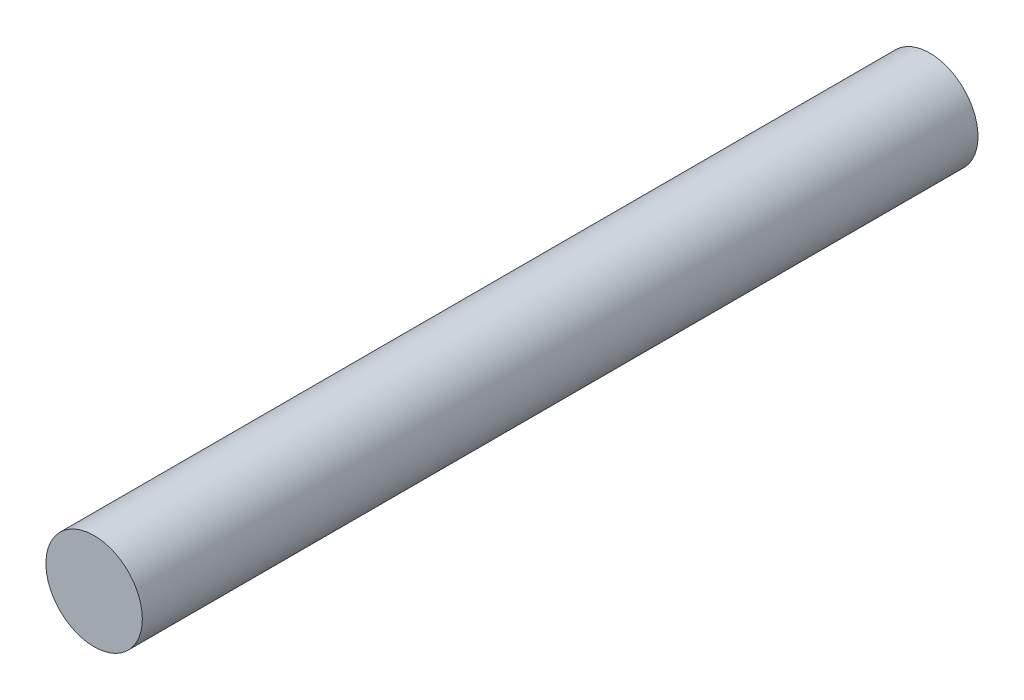
ISO-10303-21;
HEADER;
FILE_DESCRIPTION(('STEP AP214'),'2;1');
FILE_NAME('part.step','',(''),(''),'','','');
FILE_SCHEMA(('AUTOMOTIVE_DESIGN { 1 0 10303 214 1 1 1 1 }'));
ENDSEC;
DATA;
#1=APPLICATION_CONTEXT('core data for automotive mechanical design processes');
#2=APPLICATION_PROTOCOL_DEFINITION('international standard','automotive_design',2000,#1);
#3=PRODUCT_CONTEXT('',#1,'mechanical');
#4=PRODUCT('Part','Part','',(#3));
#5=PRODUCT_RELATED_PRODUCT_CATEGORY('part','',(#4));
#6=PRODUCT_DEFINITION_FORMATION('','',#4);
#7=PRODUCT_DEFINITION_CONTEXT('part definition',#1,'design');
#8=PRODUCT_DEFINITION('design','',#6,#7);
#9=PRODUCT_DEFINITION_SHAPE('','',#8);
#10=(LENGTH_UNIT() NAMED_UNIT(*) SI_UNIT(.MILLI.,.METRE.));
#11=(NAMED_UNIT(*) PLANE_ANGLE_UNIT() SI_UNIT($,.RADIAN.));
#12=(NAMED_UNIT(*) SI_UNIT($,.STERADIAN.) SOLID_ANGLE_UNIT());
#13=UNCERTAINTY_MEASURE_WITH_UNIT(LENGTH_MEASURE(1.E-05),#10,'distance_accuracy_value','');
#14=(GEOMETRIC_REPRESENTATION_CONTEXT(3) GLOBAL_UNCERTAINTY_ASSIGNED_CONTEXT((#13)) GLOBAL_UNIT_ASSIGNED_CONTEXT((#10,
#11,#12)) REPRESENTATION_CONTEXT('',''));
#15=CARTESIAN_POINT('',(0.,0.,0.));
#16=DIRECTION('',(0.,0.,1.));
#17=DIRECTION('',(1.,0.,0.));
#18=AXIS2_PLACEMENT_3D('',#15,#16,#17);
#19=CARTESIAN_POINT('',(0.,0.,52.));
#20=DIRECTION('',(0.,0.,-1.));
#21=DIRECTION('',(-1.,0.,0.));
#22=AXIS2_PLACEMENT_3D('',#19,#20,#21);
#23=CYLINDRICAL_SURFACE('',#22,3.);
#24=CARTESIAN_POINT('',(0.,0.,52.));
#25=DIRECTION('',(0.,0.,1.));
#26=DIRECTION('',(1.,0.,0.));
#27=AXIS2_PLACEMENT_3D('',#24,#25,#26);
#28=CIRCLE('',#27,3.);
#29=CARTESIAN_POINT('',(3.,0.,52.));
#30=VERTEX_POINT('',#29);
#31=EDGE_CURVE('E10',#30,#30,#28,.T.);
#32=ORIENTED_EDGE('',*,*,#31,.F.);
#33=EDGE_LOOP('',(#32));
#34=FACE_BOUND('',#33,.T.);
#35=CARTESIAN_POINT('',(0.,0.,0.));
#36=DIRECTION('',(0.,0.,1.));
#37=DIRECTION('',(1.,0.,0.));
#38=AXIS2_PLACEMENT_3D('',#35,#36,#37);
#39=CIRCLE('',#38,3.);
#40=CARTESIAN_POINT('',(3.,0.,0.));
#41=VERTEX_POINT('',#40);
#42=EDGE_CURVE('E33',#41,#41,#39,.T.);
#43=ORIENTED_EDGE('',*,*,#42,.T.);
#44=EDGE_LOOP('',(#43));
#45=FACE_BOUND('',#44,.T.);
#46=ADVANCED_FACE('F30',(#34,#45),#23,.T.);
#47=CARTESIAN_POINT('',(0.,0.,52.));
#48=DIRECTION('',(0.,0.,1.));
#49=DIRECTION('',(1.,0.,0.));
#50=AXIS2_PLACEMENT_3D('',#47,#48,#49);
#51=PLANE('',#50);
#52=ORIENTED_EDGE('',*,*,#31,.T.);
#53=EDGE_LOOP('',(#52));
#54=FACE_BOUND('',#53,.T.);
#55=ADVANCED_FACE('F45',(#54),#51,.T.);
#56=CARTESIAN_POINT('',(0.,0.,0.));
#57=DIRECTION('',(0.,0.,1.));
#58=DIRECTION('',(1.,0.,0.));
#59=AXIS2_PLACEMENT_3D('',#56,#57,#58);
#60=PLANE('',#59);
#61=ORIENTED_EDGE('',*,*,#42,.F.);
#62=EDGE_LOOP('',(#61));
#63=FACE_BOUND('',#62,.T.);
#64=ADVANCED_FACE('F43',(#63),#60,.F.);
#65=CLOSED_SHELL('',(#46,#55,#64));
#66=MANIFOLD_SOLID_BREP('B2',#65);
#67=ADVANCED_BREP_SHAPE_REPRESENTATION('',(#18,#66),#14);
#68=SHAPE_DEFINITION_REPRESENTATION(#9,#67);
ENDSEC;
END-ISO-10303-21;
